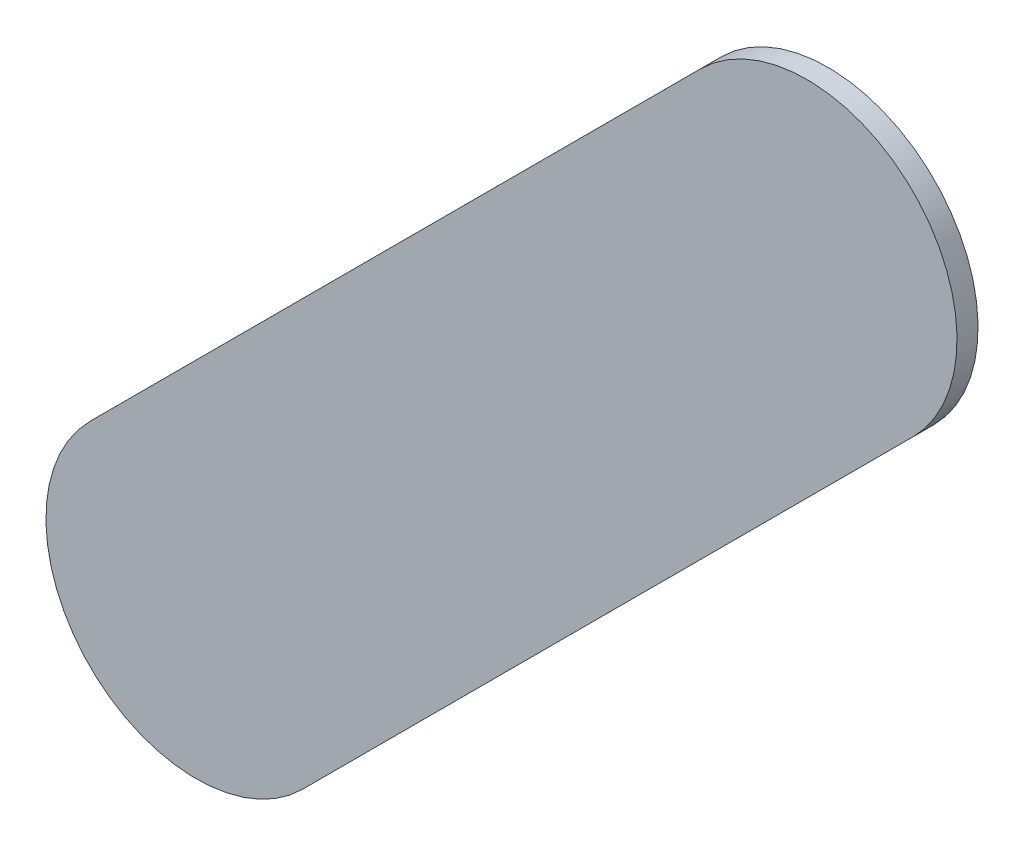
ISO-10303-21;
HEADER;
FILE_DESCRIPTION(('STEP AP214'),'2;1');
FILE_NAME('part.step','',(''),(''),'','','');
FILE_SCHEMA(('AUTOMOTIVE_DESIGN { 1 0 10303 214 1 1 1 1 }'));
ENDSEC;
DATA;
#1=APPLICATION_CONTEXT('core data for automotive mechanical design processes');
#2=APPLICATION_PROTOCOL_DEFINITION('international standard','automotive_design',2000,#1);
#3=PRODUCT_CONTEXT('',#1,'mechanical');
#4=PRODUCT('Part','Part','',(#3));
#5=PRODUCT_RELATED_PRODUCT_CATEGORY('part','',(#4));
#6=PRODUCT_DEFINITION_FORMATION('','',#4);
#7=PRODUCT_DEFINITION_CONTEXT('part definition',#1,'design');
#8=PRODUCT_DEFINITION('design','',#6,#7);
#9=PRODUCT_DEFINITION_SHAPE('','',#8);
#10=(LENGTH_UNIT() NAMED_UNIT(*) SI_UNIT(.MILLI.,.METRE.));
#11=(NAMED_UNIT(*) PLANE_ANGLE_UNIT() SI_UNIT($,.RADIAN.));
#12=(NAMED_UNIT(*) SI_UNIT($,.STERADIAN.) SOLID_ANGLE_UNIT());
#13=UNCERTAINTY_MEASURE_WITH_UNIT(LENGTH_MEASURE(1.E-05),#10,'distance_accuracy_value','');
#14=(GEOMETRIC_REPRESENTATION_CONTEXT(3) GLOBAL_UNCERTAINTY_ASSIGNED_CONTEXT((#13)) GLOBAL_UNIT_ASSIGNED_CONTEXT((#10,
#11,#12)) REPRESENTATION_CONTEXT('',''));
#15=CARTESIAN_POINT('',(0.,0.,0.));
#16=DIRECTION('',(0.,0.,1.));
#17=DIRECTION('',(1.,0.,0.));
#18=AXIS2_PLACEMENT_3D('',#15,#16,#17);
#19=CARTESIAN_POINT('',(119.302776,-100.887776,0.));
#20=DIRECTION('',(0.,0.,1.));
#21=DIRECTION('',(1.,0.,0.));
#22=AXIS2_PLACEMENT_3D('',#19,#20,#21);
#23=PLANE('',#22);
#24=DIRECTION('',(0.707106781186548,0.707106781186548,0.));
#25=VECTOR('',#24,1.);
#26=CARTESIAN_POINT('',(119.302776,-100.887776,0.));
#27=LINE('',#26,#25);
#28=CARTESIAN_POINT('',(119.302776,-100.887776,0.));
#29=VERTEX_POINT('',#28);
#30=CARTESIAN_POINT('',(120.318776,-99.871776,0.));
#31=VERTEX_POINT('',#30);
#32=EDGE_CURVE('E82',#29,#31,#27,.T.);
#33=ORIENTED_EDGE('',*,*,#32,.T.);
#34=CARTESIAN_POINT('',(120.1419995,-99.6949995,0.));
#35=DIRECTION('',(0.,0.,1.));
#36=DIRECTION('',(0.707106781186548,-0.707106781186548,0.));
#37=AXIS2_PLACEMENT_3D('',#34,#35,#36);
#38=CIRCLE('',#37,0.249999723809);
#39=CARTESIAN_POINT('',(119.965223,-99.518223,0.));
#40=VERTEX_POINT('',#39);
#41=EDGE_CURVE('E102',#31,#40,#38,.T.);
#42=ORIENTED_EDGE('',*,*,#41,.T.);
#43=DIRECTION('',(-0.707106781186548,-0.707106781186548,0.));
#44=VECTOR('',#43,1.);
#45=CARTESIAN_POINT('',(119.965223,-99.518223,0.));
#46=LINE('',#45,#44);
#47=CARTESIAN_POINT('',(118.949223,-100.534223,0.));
#48=VERTEX_POINT('',#47);
#49=EDGE_CURVE('E75',#40,#48,#46,.T.);
#50=ORIENTED_EDGE('',*,*,#49,.T.);
#51=CARTESIAN_POINT('',(119.1259995,-100.7109995,0.));
#52=DIRECTION('',(0.,0.,1.));
#53=DIRECTION('',(-0.707106781186548,0.707106781186548,0.));
#54=AXIS2_PLACEMENT_3D('',#51,#52,#53);
#55=CIRCLE('',#54,0.249999723809);
#56=EDGE_CURVE('E11',#48,#29,#55,.T.);
#57=ORIENTED_EDGE('',*,*,#56,.T.);
#58=EDGE_LOOP('',(#33,#42,#50,#57));
#59=FACE_BOUND('',#58,.T.);
#60=ADVANCED_FACE('F17',(#59),#23,.T.);
#61=CARTESIAN_POINT('',(119.302776,-100.887776,-0.035));
#62=DIRECTION('',(0.,0.,1.));
#63=DIRECTION('',(1.,0.,0.));
#64=AXIS2_PLACEMENT_3D('',#61,#62,#63);
#65=PLANE('',#64);
#66=CARTESIAN_POINT('',(119.1259995,-100.7109995,-0.035));
#67=DIRECTION('',(0.,0.,1.));
#68=DIRECTION('',(-0.707106781186548,0.707106781186548,0.));
#69=AXIS2_PLACEMENT_3D('',#66,#67,#68);
#70=CIRCLE('',#69,0.249999723809);
#71=CARTESIAN_POINT('',(118.949223,-100.534223,-0.035));
#72=VERTEX_POINT('',#71);
#73=CARTESIAN_POINT('',(119.302776,-100.887776,-0.035));
#74=VERTEX_POINT('',#73);
#75=EDGE_CURVE('E26',#72,#74,#70,.T.);
#76=ORIENTED_EDGE('',*,*,#75,.F.);
#77=DIRECTION('',(-0.707106781186548,-0.707106781186548,0.));
#78=VECTOR('',#77,1.);
#79=CARTESIAN_POINT('',(119.965223,-99.518223,-0.035));
#80=LINE('',#79,#78);
#81=CARTESIAN_POINT('',(119.965223,-99.518223,-0.035));
#82=VERTEX_POINT('',#81);
#83=EDGE_CURVE('E99',#82,#72,#80,.T.);
#84=ORIENTED_EDGE('',*,*,#83,.F.);
#85=CARTESIAN_POINT('',(120.1419995,-99.6949995,-0.035));
#86=DIRECTION('',(0.,0.,1.));
#87=DIRECTION('',(0.707106781186548,-0.707106781186548,0.));
#88=AXIS2_PLACEMENT_3D('',#85,#86,#87);
#89=CIRCLE('',#88,0.249999723809);
#90=CARTESIAN_POINT('',(120.318776,-99.871776,-0.035));
#91=VERTEX_POINT('',#90);
#92=EDGE_CURVE('E84',#91,#82,#89,.T.);
#93=ORIENTED_EDGE('',*,*,#92,.F.);
#94=DIRECTION('',(0.707106781186548,0.707106781186548,0.));
#95=VECTOR('',#94,1.);
#96=CARTESIAN_POINT('',(119.302776,-100.887776,-0.035));
#97=LINE('',#96,#95);
#98=EDGE_CURVE('E80',#74,#91,#97,.T.);
#99=ORIENTED_EDGE('',*,*,#98,.F.);
#100=EDGE_LOOP('',(#76,#84,#93,#99));
#101=FACE_BOUND('',#100,.T.);
#102=ADVANCED_FACE('F19',(#101),#65,.F.);
#103=CARTESIAN_POINT('',(119.1259995,-100.7109995,-0.035));
#104=DIRECTION('',(0.,0.,-1.));
#105=DIRECTION('',(-0.707106781186548,0.707106781186548,0.));
#106=AXIS2_PLACEMENT_3D('',#103,#104,#105);
#107=CYLINDRICAL_SURFACE('',#106,0.249999723809);
#108=ORIENTED_EDGE('',*,*,#75,.T.);
#109=DIRECTION('',(0.,0.,1.));
#110=VECTOR('',#109,1.);
#111=CARTESIAN_POINT('',(119.302776,-100.887776,-0.035));
#112=LINE('',#111,#110);
#113=EDGE_CURVE('E69',#74,#29,#112,.T.);
#114=ORIENTED_EDGE('',*,*,#113,.T.);
#115=ORIENTED_EDGE('',*,*,#56,.F.);
#116=DIRECTION('',(0.,0.,1.));
#117=VECTOR('',#116,1.);
#118=CARTESIAN_POINT('',(118.949223,-100.534223,-0.035));
#119=LINE('',#118,#117);
#120=EDGE_CURVE('E72',#72,#48,#119,.T.);
#121=ORIENTED_EDGE('',*,*,#120,.F.);
#122=EDGE_LOOP('',(#108,#114,#115,#121));
#123=FACE_BOUND('',#122,.T.);
#124=ADVANCED_FACE('F68',(#123),#107,.T.);
#125=CARTESIAN_POINT('',(119.965223,-99.518223,-0.035));
#126=DIRECTION('',(0.707106781186548,-0.707106781186548,0.));
#127=DIRECTION('',(0.,0.,-1.));
#128=AXIS2_PLACEMENT_3D('',#125,#126,#127);
#129=PLANE('',#128);
#130=ORIENTED_EDGE('',*,*,#83,.T.);
#131=ORIENTED_EDGE('',*,*,#120,.T.);
#132=ORIENTED_EDGE('',*,*,#49,.F.);
#133=DIRECTION('',(0.,0.,1.));
#134=VECTOR('',#133,1.);
#135=CARTESIAN_POINT('',(119.965223,-99.518223,-0.035));
#136=LINE('',#135,#134);
#137=EDGE_CURVE('E105',#82,#40,#136,.T.);
#138=ORIENTED_EDGE('',*,*,#137,.F.);
#139=EDGE_LOOP('',(#130,#131,#132,#138));
#140=FACE_BOUND('',#139,.T.);
#141=ADVANCED_FACE('F120',(#140),#129,.F.);
#142=CARTESIAN_POINT('',(120.1419995,-99.6949995,-0.035));
#143=DIRECTION('',(0.,0.,-1.));
#144=DIRECTION('',(0.707106781186548,-0.707106781186548,0.));
#145=AXIS2_PLACEMENT_3D('',#142,#143,#144);
#146=CYLINDRICAL_SURFACE('',#145,0.249999723809);
#147=ORIENTED_EDGE('',*,*,#92,.T.);
#148=ORIENTED_EDGE('',*,*,#137,.T.);
#149=ORIENTED_EDGE('',*,*,#41,.F.);
#150=DIRECTION('',(0.,0.,1.));
#151=VECTOR('',#150,1.);
#152=CARTESIAN_POINT('',(120.318776,-99.871776,-0.035));
#153=LINE('',#152,#151);
#154=EDGE_CURVE('E89',#91,#31,#153,.T.);
#155=ORIENTED_EDGE('',*,*,#154,.F.);
#156=EDGE_LOOP('',(#147,#148,#149,#155));
#157=FACE_BOUND('',#156,.T.);
#158=ADVANCED_FACE('F122',(#157),#146,.T.);
#159=CARTESIAN_POINT('',(119.302776,-100.887776,-0.035));
#160=DIRECTION('',(-0.707106781186548,0.707106781186548,0.));
#161=DIRECTION('',(0.,0.,1.));
#162=AXIS2_PLACEMENT_3D('',#159,#160,#161);
#163=PLANE('',#162);
#164=ORIENTED_EDGE('',*,*,#98,.T.);
#165=ORIENTED_EDGE('',*,*,#154,.T.);
#166=ORIENTED_EDGE('',*,*,#32,.F.);
#167=ORIENTED_EDGE('',*,*,#113,.F.);
#168=EDGE_LOOP('',(#164,#165,#166,#167));
#169=FACE_BOUND('',#168,.T.);
#170=ADVANCED_FACE('F78',(#169),#163,.F.);
#171=CLOSED_SHELL('',(#60,#102,#124,#141,#158,#170));
#172=MANIFOLD_SOLID_BREP('B1',#171);
#173=ADVANCED_BREP_SHAPE_REPRESENTATION('',(#18,#172),#14);
#174=SHAPE_DEFINITION_REPRESENTATION(#9,#173);
ENDSEC;
END-ISO-10303-21;
